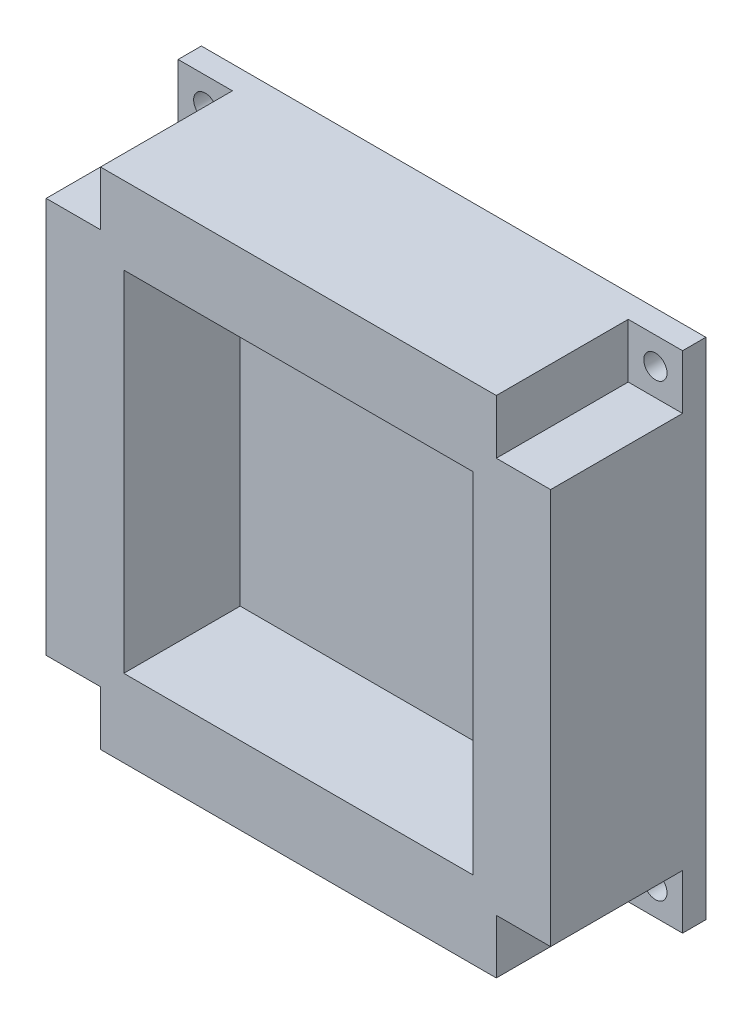
ISO-10303-21;
HEADER;
FILE_DESCRIPTION(('STEP AP214'),'2;1');
FILE_NAME('part.step','',(''),(''),'','','');
FILE_SCHEMA(('AUTOMOTIVE_DESIGN { 1 0 10303 214 1 1 1 1 }'));
ENDSEC;
DATA;
#1=APPLICATION_CONTEXT('core data for automotive mechanical design processes');
#2=APPLICATION_PROTOCOL_DEFINITION('international standard','automotive_design',2000,#1);
#3=PRODUCT_CONTEXT('',#1,'mechanical');
#4=PRODUCT('Part','Part','',(#3));
#5=PRODUCT_RELATED_PRODUCT_CATEGORY('part','',(#4));
#6=PRODUCT_DEFINITION_FORMATION('','',#4);
#7=PRODUCT_DEFINITION_CONTEXT('part definition',#1,'design');
#8=PRODUCT_DEFINITION('design','',#6,#7);
#9=PRODUCT_DEFINITION_SHAPE('','',#8);
#10=(LENGTH_UNIT() NAMED_UNIT(*) SI_UNIT(.MILLI.,.METRE.));
#11=(NAMED_UNIT(*) PLANE_ANGLE_UNIT() SI_UNIT($,.RADIAN.));
#12=(NAMED_UNIT(*) SI_UNIT($,.STERADIAN.) SOLID_ANGLE_UNIT());
#13=UNCERTAINTY_MEASURE_WITH_UNIT(LENGTH_MEASURE(1.E-05),#10,'distance_accuracy_value','');
#14=(GEOMETRIC_REPRESENTATION_CONTEXT(3) GLOBAL_UNCERTAINTY_ASSIGNED_CONTEXT((#13)) GLOBAL_UNIT_ASSIGNED_CONTEXT((#10,
#11,#12)) REPRESENTATION_CONTEXT('',''));
#15=CARTESIAN_POINT('',(0.,0.,0.));
#16=DIRECTION('',(0.,0.,1.));
#17=DIRECTION('',(1.,0.,0.));
#18=AXIS2_PLACEMENT_3D('',#15,#16,#17);
#19=CARTESIAN_POINT('',(32.5,32.5,20.));
#20=DIRECTION('',(-1.,0.,0.));
#21=DIRECTION('',(0.,-1.,0.));
#22=AXIS2_PLACEMENT_3D('',#19,#20,#21);
#23=PLANE('',#22);
#24=DIRECTION('',(0.,1.,0.));
#25=VECTOR('',#24,1.);
#26=CARTESIAN_POINT('',(32.5,32.5,20.));
#27=LINE('',#26,#25);
#28=CARTESIAN_POINT('',(32.5,-25.5,20.));
#29=VERTEX_POINT('',#28);
#30=CARTESIAN_POINT('',(32.4999999999997,25.5000000000003,20.));
#31=VERTEX_POINT('',#30);
#32=EDGE_CURVE('E302',#29,#31,#27,.T.);
#33=ORIENTED_EDGE('',*,*,#32,.F.);
#34=DIRECTION('',(0.,0.,1.));
#35=VECTOR('',#34,1.);
#36=CARTESIAN_POINT('',(32.5,-25.5,3.00000000000003));
#37=LINE('',#36,#35);
#38=CARTESIAN_POINT('',(32.5,-25.5,3.00000000000003));
#39=VERTEX_POINT('',#38);
#40=EDGE_CURVE('E55',#39,#29,#37,.T.);
#41=ORIENTED_EDGE('',*,*,#40,.F.);
#42=DIRECTION('',(0.,1.,0.));
#43=VECTOR('',#42,1.);
#44=CARTESIAN_POINT('',(32.5,-32.5,3.00000000000003));
#45=LINE('',#44,#43);
#46=CARTESIAN_POINT('',(32.5,-32.5,3.00000000000003));
#47=VERTEX_POINT('',#46);
#48=EDGE_CURVE('E202',#47,#39,#45,.T.);
#49=ORIENTED_EDGE('',*,*,#48,.F.);
#50=DIRECTION('',(0.,0.,-1.));
#51=VECTOR('',#50,1.);
#52=CARTESIAN_POINT('',(32.5,-32.5,20.));
#53=LINE('',#52,#51);
#54=CARTESIAN_POINT('',(32.5,-32.5,0.));
#55=VERTEX_POINT('',#54);
#56=EDGE_CURVE('E312',#47,#55,#53,.T.);
#57=ORIENTED_EDGE('',*,*,#56,.T.);
#58=DIRECTION('',(0.,1.,0.));
#59=VECTOR('',#58,1.);
#60=CARTESIAN_POINT('',(32.5,32.5,0.));
#61=LINE('',#60,#59);
#62=CARTESIAN_POINT('',(32.5,32.5,0.));
#63=VERTEX_POINT('',#62);
#64=EDGE_CURVE('E295',#55,#63,#61,.T.);
#65=ORIENTED_EDGE('',*,*,#64,.T.);
#66=DIRECTION('',(0.,0.,-1.));
#67=VECTOR('',#66,1.);
#68=CARTESIAN_POINT('',(32.5,32.5,20.));
#69=LINE('',#68,#67);
#70=CARTESIAN_POINT('',(32.4999999999997,32.5000000000003,3.00000000000003));
#71=VERTEX_POINT('',#70);
#72=EDGE_CURVE('E11',#71,#63,#69,.T.);
#73=ORIENTED_EDGE('',*,*,#72,.F.);
#74=DIRECTION('',(0.,1.,0.));
#75=VECTOR('',#74,1.);
#76=CARTESIAN_POINT('',(32.4999999999997,32.5000000000003,3.00000000000003));
#77=LINE('',#76,#75);
#78=CARTESIAN_POINT('',(32.4999999999997,25.5000000000003,3.00000000000003));
#79=VERTEX_POINT('',#78);
#80=EDGE_CURVE('E234',#79,#71,#77,.T.);
#81=ORIENTED_EDGE('',*,*,#80,.F.);
#82=DIRECTION('',(0.,0.,1.));
#83=VECTOR('',#82,1.);
#84=CARTESIAN_POINT('',(32.4999999999997,25.5000000000003,3.00000000000003));
#85=LINE('',#84,#83);
#86=EDGE_CURVE('E216',#79,#31,#85,.T.);
#87=ORIENTED_EDGE('',*,*,#86,.T.);
#88=EDGE_LOOP('',(#33,#41,#49,#57,#65,#73,#81,#87));
#89=FACE_BOUND('',#88,.T.);
#90=ADVANCED_FACE('F33',(#89),#23,.F.);
#91=CARTESIAN_POINT('',(-32.5,32.5,20.));
#92=DIRECTION('',(0.,-1.,0.));
#93=DIRECTION('',(0.,0.,-1.));
#94=AXIS2_PLACEMENT_3D('',#91,#92,#93);
#95=PLANE('',#94);
#96=DIRECTION('',(-1.,0.,0.));
#97=VECTOR('',#96,1.);
#98=CARTESIAN_POINT('',(-32.5,32.5,20.));
#99=LINE('',#98,#97);
#100=CARTESIAN_POINT('',(25.4999999999997,32.5,20.));
#101=VERTEX_POINT('',#100);
#102=CARTESIAN_POINT('',(-25.5,32.5,20.));
#103=VERTEX_POINT('',#102);
#104=EDGE_CURVE('E305',#101,#103,#99,.T.);
#105=ORIENTED_EDGE('',*,*,#104,.F.);
#106=DIRECTION('',(0.,0.,1.));
#107=VECTOR('',#106,1.);
#108=CARTESIAN_POINT('',(25.4999999999997,32.5000000000003,3.00000000000003));
#109=LINE('',#108,#107);
#110=CARTESIAN_POINT('',(25.4999999999997,32.5000000000003,3.00000000000003));
#111=VERTEX_POINT('',#110);
#112=EDGE_CURVE('E47',#111,#101,#109,.T.);
#113=ORIENTED_EDGE('',*,*,#112,.F.);
#114=DIRECTION('',(-1.,0.,0.));
#115=VECTOR('',#114,1.);
#116=CARTESIAN_POINT('',(32.4999999999997,32.5000000000003,3.00000000000003));
#117=LINE('',#116,#115);
#118=EDGE_CURVE('E224',#71,#111,#117,.T.);
#119=ORIENTED_EDGE('',*,*,#118,.F.);
#120=ORIENTED_EDGE('',*,*,#72,.T.);
#121=DIRECTION('',(-1.,0.,0.));
#122=VECTOR('',#121,1.);
#123=CARTESIAN_POINT('',(-32.5,32.5,0.));
#124=LINE('',#123,#122);
#125=CARTESIAN_POINT('',(-32.5,32.5,0.));
#126=VERTEX_POINT('',#125);
#127=EDGE_CURVE('E315',#63,#126,#124,.T.);
#128=ORIENTED_EDGE('',*,*,#127,.T.);
#129=DIRECTION('',(0.,0.,-1.));
#130=VECTOR('',#129,1.);
#131=CARTESIAN_POINT('',(-32.5,32.5,20.));
#132=LINE('',#131,#130);
#133=CARTESIAN_POINT('',(-32.5,32.5,3.00000000000003));
#134=VERTEX_POINT('',#133);
#135=EDGE_CURVE('E40',#134,#126,#132,.T.);
#136=ORIENTED_EDGE('',*,*,#135,.F.);
#137=DIRECTION('',(-1.,0.,0.));
#138=VECTOR('',#137,1.);
#139=CARTESIAN_POINT('',(-32.5,32.5,3.00000000000003));
#140=LINE('',#139,#138);
#141=CARTESIAN_POINT('',(-25.5,32.5,3.00000000000003));
#142=VERTEX_POINT('',#141);
#143=EDGE_CURVE('E255',#142,#134,#140,.T.);
#144=ORIENTED_EDGE('',*,*,#143,.F.);
#145=DIRECTION('',(0.,0.,1.));
#146=VECTOR('',#145,1.);
#147=CARTESIAN_POINT('',(-25.5,32.5,3.00000000000003));
#148=LINE('',#147,#146);
#149=EDGE_CURVE('E263',#142,#103,#148,.T.);
#150=ORIENTED_EDGE('',*,*,#149,.T.);
#151=EDGE_LOOP('',(#105,#113,#119,#120,#128,#136,#144,#150));
#152=FACE_BOUND('',#151,.T.);
#153=ADVANCED_FACE('F336',(#152),#95,.F.);
#154=CARTESIAN_POINT('',(-32.5,32.5,20.));
#155=DIRECTION('',(1.,0.,0.));
#156=DIRECTION('',(0.,1.,0.));
#157=AXIS2_PLACEMENT_3D('',#154,#155,#156);
#158=PLANE('',#157);
#159=DIRECTION('',(0.,-1.,0.));
#160=VECTOR('',#159,1.);
#161=CARTESIAN_POINT('',(-32.4999999999999,-32.5000000000001,3.00000000000003));
#162=LINE('',#161,#160);
#163=CARTESIAN_POINT('',(-32.4999999999999,-25.5000000000001,3.00000000000003));
#164=VERTEX_POINT('',#163);
#165=CARTESIAN_POINT('',(-32.4999999999999,-32.5000000000001,3.00000000000003));
#166=VERTEX_POINT('',#165);
#167=EDGE_CURVE('E186',#164,#166,#162,.T.);
#168=ORIENTED_EDGE('',*,*,#167,.F.);
#169=DIRECTION('',(0.,0.,1.));
#170=VECTOR('',#169,1.);
#171=CARTESIAN_POINT('',(-32.4999999999999,-25.5000000000001,3.00000000000003));
#172=LINE('',#171,#170);
#173=CARTESIAN_POINT('',(-32.4999999999999,-25.5000000000001,20.));
#174=VERTEX_POINT('',#173);
#175=EDGE_CURVE('E197',#164,#174,#172,.T.);
#176=ORIENTED_EDGE('',*,*,#175,.T.);
#177=DIRECTION('',(0.,-1.,0.));
#178=VECTOR('',#177,1.);
#179=CARTESIAN_POINT('',(-32.5,32.5,20.));
#180=LINE('',#179,#178);
#181=CARTESIAN_POINT('',(-32.5,25.5,20.));
#182=VERTEX_POINT('',#181);
#183=EDGE_CURVE('E308',#182,#174,#180,.T.);
#184=ORIENTED_EDGE('',*,*,#183,.F.);
#185=DIRECTION('',(0.,0.,1.));
#186=VECTOR('',#185,1.);
#187=CARTESIAN_POINT('',(-32.5,25.5,3.00000000000003));
#188=LINE('',#187,#186);
#189=CARTESIAN_POINT('',(-32.5,25.5,3.00000000000003));
#190=VERTEX_POINT('',#189);
#191=EDGE_CURVE('E257',#190,#182,#188,.T.);
#192=ORIENTED_EDGE('',*,*,#191,.F.);
#193=DIRECTION('',(0.,-1.,0.));
#194=VECTOR('',#193,1.);
#195=CARTESIAN_POINT('',(-32.5,32.5,3.00000000000003));
#196=LINE('',#195,#194);
#197=EDGE_CURVE('E245',#134,#190,#196,.T.);
#198=ORIENTED_EDGE('',*,*,#197,.F.);
#199=ORIENTED_EDGE('',*,*,#135,.T.);
#200=DIRECTION('',(0.,-1.,0.));
#201=VECTOR('',#200,1.);
#202=CARTESIAN_POINT('',(-32.5,32.5,0.));
#203=LINE('',#202,#201);
#204=CARTESIAN_POINT('',(-32.5,-32.5,0.));
#205=VERTEX_POINT('',#204);
#206=EDGE_CURVE('E318',#126,#205,#203,.T.);
#207=ORIENTED_EDGE('',*,*,#206,.T.);
#208=DIRECTION('',(0.,0.,-1.));
#209=VECTOR('',#208,1.);
#210=CARTESIAN_POINT('',(-32.5,-32.5,20.));
#211=LINE('',#210,#209);
#212=EDGE_CURVE('E324',#166,#205,#211,.T.);
#213=ORIENTED_EDGE('',*,*,#212,.F.);
#214=EDGE_LOOP('',(#168,#176,#184,#192,#198,#199,#207,#213));
#215=FACE_BOUND('',#214,.T.);
#216=ADVANCED_FACE('F328',(#215),#158,.F.);
#217=CARTESIAN_POINT('',(-32.5,-32.5,20.));
#218=DIRECTION('',(0.,1.,0.));
#219=DIRECTION('',(0.,0.,1.));
#220=AXIS2_PLACEMENT_3D('',#217,#218,#219);
#221=PLANE('',#220);
#222=DIRECTION('',(1.,0.,0.));
#223=VECTOR('',#222,1.);
#224=CARTESIAN_POINT('',(-32.5,-32.5,20.));
#225=LINE('',#224,#223);
#226=CARTESIAN_POINT('',(-25.4999999999999,-32.5,20.));
#227=VERTEX_POINT('',#226);
#228=CARTESIAN_POINT('',(25.5,-32.5,20.));
#229=VERTEX_POINT('',#228);
#230=EDGE_CURVE('E195',#227,#229,#225,.T.);
#231=ORIENTED_EDGE('',*,*,#230,.F.);
#232=DIRECTION('',(0.,0.,1.));
#233=VECTOR('',#232,1.);
#234=CARTESIAN_POINT('',(-25.4999999999999,-32.5000000000001,3.00000000000003));
#235=LINE('',#234,#233);
#236=CARTESIAN_POINT('',(-25.4999999999999,-32.5000000000001,3.00000000000003));
#237=VERTEX_POINT('',#236);
#238=EDGE_CURVE('E174',#237,#227,#235,.T.);
#239=ORIENTED_EDGE('',*,*,#238,.F.);
#240=DIRECTION('',(1.,0.,0.));
#241=VECTOR('',#240,1.);
#242=CARTESIAN_POINT('',(-32.4999999999999,-32.5000000000001,3.00000000000003));
#243=LINE('',#242,#241);
#244=EDGE_CURVE('E181',#166,#237,#243,.T.);
#245=ORIENTED_EDGE('',*,*,#244,.F.);
#246=ORIENTED_EDGE('',*,*,#212,.T.);
#247=DIRECTION('',(1.,0.,0.));
#248=VECTOR('',#247,1.);
#249=CARTESIAN_POINT('',(-32.5,-32.5,0.));
#250=LINE('',#249,#248);
#251=EDGE_CURVE('E306',#205,#55,#250,.T.);
#252=ORIENTED_EDGE('',*,*,#251,.T.);
#253=ORIENTED_EDGE('',*,*,#56,.F.);
#254=DIRECTION('',(1.,0.,0.));
#255=VECTOR('',#254,1.);
#256=CARTESIAN_POINT('',(32.5,-32.5,3.00000000000003));
#257=LINE('',#256,#255);
#258=CARTESIAN_POINT('',(25.5,-32.5,3.00000000000003));
#259=VERTEX_POINT('',#258);
#260=EDGE_CURVE('E212',#259,#47,#257,.T.);
#261=ORIENTED_EDGE('',*,*,#260,.F.);
#262=DIRECTION('',(0.,0.,1.));
#263=VECTOR('',#262,1.);
#264=CARTESIAN_POINT('',(25.5,-32.5,3.00000000000003));
#265=LINE('',#264,#263);
#266=EDGE_CURVE('E218',#259,#229,#265,.T.);
#267=ORIENTED_EDGE('',*,*,#266,.T.);
#268=EDGE_LOOP('',(#231,#239,#245,#246,#252,#253,#261,#267));
#269=FACE_BOUND('',#268,.T.);
#270=ADVANCED_FACE('F192',(#269),#221,.F.);
#271=CARTESIAN_POINT('',(0.,0.,20.));
#272=DIRECTION('',(0.,0.,1.));
#273=DIRECTION('',(1.,0.,0.));
#274=AXIS2_PLACEMENT_3D('',#271,#272,#273);
#275=PLANE('',#274);
#276=DIRECTION('',(-1.,0.,0.));
#277=VECTOR('',#276,1.);
#278=CARTESIAN_POINT('',(-32.4999999999999,-25.5000000000001,20.));
#279=LINE('',#278,#277);
#280=CARTESIAN_POINT('',(-25.4999999999999,-25.5000000000001,20.));
#281=VERTEX_POINT('',#280);
#282=EDGE_CURVE('E189',#281,#174,#279,.T.);
#283=ORIENTED_EDGE('',*,*,#282,.F.);
#284=DIRECTION('',(0.,1.,0.));
#285=VECTOR('',#284,1.);
#286=CARTESIAN_POINT('',(-25.4999999999999,-32.5000000000001,20.));
#287=LINE('',#286,#285);
#288=EDGE_CURVE('E220',#227,#281,#287,.T.);
#289=ORIENTED_EDGE('',*,*,#288,.F.);
#290=ORIENTED_EDGE('',*,*,#230,.T.);
#291=DIRECTION('',(0.,-1.,0.));
#292=VECTOR('',#291,1.);
#293=CARTESIAN_POINT('',(25.5,-32.5,20.));
#294=LINE('',#293,#292);
#295=CARTESIAN_POINT('',(25.5,-25.5,20.));
#296=VERTEX_POINT('',#295);
#297=EDGE_CURVE('E206',#296,#229,#294,.T.);
#298=ORIENTED_EDGE('',*,*,#297,.F.);
#299=DIRECTION('',(-1.,0.,0.));
#300=VECTOR('',#299,1.);
#301=CARTESIAN_POINT('',(32.5,-25.5,20.));
#302=LINE('',#301,#300);
#303=EDGE_CURVE('E214',#29,#296,#302,.T.);
#304=ORIENTED_EDGE('',*,*,#303,.F.);
#305=ORIENTED_EDGE('',*,*,#32,.T.);
#306=DIRECTION('',(1.,0.,0.));
#307=VECTOR('',#306,1.);
#308=CARTESIAN_POINT('',(32.4999999999997,25.5000000000003,20.));
#309=LINE('',#308,#307);
#310=CARTESIAN_POINT('',(25.4999999999997,25.5000000000003,20.));
#311=VERTEX_POINT('',#310);
#312=EDGE_CURVE('E228',#311,#31,#309,.T.);
#313=ORIENTED_EDGE('',*,*,#312,.F.);
#314=DIRECTION('',(0.,-1.,0.));
#315=VECTOR('',#314,1.);
#316=CARTESIAN_POINT('',(25.4999999999997,32.5000000000003,20.));
#317=LINE('',#316,#315);
#318=EDGE_CURVE('E236',#101,#311,#317,.T.);
#319=ORIENTED_EDGE('',*,*,#318,.F.);
#320=ORIENTED_EDGE('',*,*,#104,.T.);
#321=DIRECTION('',(0.,1.,0.));
#322=VECTOR('',#321,1.);
#323=CARTESIAN_POINT('',(-25.5,32.5,20.));
#324=LINE('',#323,#322);
#325=CARTESIAN_POINT('',(-25.5,25.5,20.));
#326=VERTEX_POINT('',#325);
#327=EDGE_CURVE('E249',#326,#103,#324,.T.);
#328=ORIENTED_EDGE('',*,*,#327,.F.);
#329=DIRECTION('',(1.,0.,0.));
#330=VECTOR('',#329,1.);
#331=CARTESIAN_POINT('',(-32.5,25.5,20.));
#332=LINE('',#331,#330);
#333=EDGE_CURVE('E258',#182,#326,#332,.T.);
#334=ORIENTED_EDGE('',*,*,#333,.F.);
#335=ORIENTED_EDGE('',*,*,#183,.T.);
#336=EDGE_LOOP('',(#283,#289,#290,#298,#304,#305,#313,#319,#320,#328,#334,#335));
#337=FACE_BOUND('',#336,.T.);
#338=DIRECTION('',(0.,1.,0.));
#339=VECTOR('',#338,1.);
#340=CARTESIAN_POINT('',(22.5,22.5,20.));
#341=LINE('',#340,#339);
#342=CARTESIAN_POINT('',(22.5,-22.5,20.));
#343=VERTEX_POINT('',#342);
#344=CARTESIAN_POINT('',(22.5,22.5,20.));
#345=VERTEX_POINT('',#344);
#346=EDGE_CURVE('E266',#343,#345,#341,.T.);
#347=ORIENTED_EDGE('',*,*,#346,.F.);
#348=DIRECTION('',(1.,0.,0.));
#349=VECTOR('',#348,1.);
#350=CARTESIAN_POINT('',(-22.5,-22.5,20.));
#351=LINE('',#350,#349);
#352=CARTESIAN_POINT('',(-22.5,-22.5,20.));
#353=VERTEX_POINT('',#352);
#354=EDGE_CURVE('E274',#353,#343,#351,.T.);
#355=ORIENTED_EDGE('',*,*,#354,.F.);
#356=DIRECTION('',(0.,-1.,0.));
#357=VECTOR('',#356,1.);
#358=CARTESIAN_POINT('',(-22.5,22.5,20.));
#359=LINE('',#358,#357);
#360=CARTESIAN_POINT('',(-22.5,22.5,20.));
#361=VERTEX_POINT('',#360);
#362=EDGE_CURVE('E288',#361,#353,#359,.T.);
#363=ORIENTED_EDGE('',*,*,#362,.F.);
#364=DIRECTION('',(-1.,0.,0.));
#365=VECTOR('',#364,1.);
#366=CARTESIAN_POINT('',(-22.5,22.5,20.));
#367=LINE('',#366,#365);
#368=EDGE_CURVE('E285',#345,#361,#367,.T.);
#369=ORIENTED_EDGE('',*,*,#368,.F.);
#370=EDGE_LOOP('',(#347,#355,#363,#369));
#371=FACE_BOUND('',#370,.T.);
#372=ADVANCED_FACE('F350',(#337,#371),#275,.T.);
#373=CARTESIAN_POINT('',(0.,0.,0.));
#374=DIRECTION('',(0.,0.,1.));
#375=DIRECTION('',(1.,0.,0.));
#376=AXIS2_PLACEMENT_3D('',#373,#374,#375);
#377=PLANE('',#376);
#378=CARTESIAN_POINT('',(-28.9999999999999,-29.0000000000001,0.));
#379=DIRECTION('',(0.,0.,1.));
#380=DIRECTION('',(0.,1.,0.));
#381=AXIS2_PLACEMENT_3D('',#378,#379,#380);
#382=CIRCLE('',#381,1.5);
#383=CARTESIAN_POINT('',(-28.9999999999999,-27.5000000000001,0.));
#384=VERTEX_POINT('',#383);
#385=EDGE_CURVE('E411',#384,#384,#382,.T.);
#386=ORIENTED_EDGE('',*,*,#385,.T.);
#387=EDGE_LOOP('',(#386));
#388=FACE_BOUND('',#387,.T.);
#389=CARTESIAN_POINT('',(29.,-29.,0.));
#390=DIRECTION('',(0.,0.,1.));
#391=DIRECTION('',(-1.,0.,0.));
#392=AXIS2_PLACEMENT_3D('',#389,#390,#391);
#393=CIRCLE('',#392,1.5);
#394=CARTESIAN_POINT('',(27.5,-29.,0.));
#395=VERTEX_POINT('',#394);
#396=EDGE_CURVE('E647',#395,#395,#393,.T.);
#397=ORIENTED_EDGE('',*,*,#396,.T.);
#398=EDGE_LOOP('',(#397));
#399=FACE_BOUND('',#398,.T.);
#400=CARTESIAN_POINT('',(28.9999999999997,29.0000000000003,0.));
#401=DIRECTION('',(0.,0.,1.));
#402=DIRECTION('',(0.,-1.,0.));
#403=AXIS2_PLACEMENT_3D('',#400,#401,#402);
#404=CIRCLE('',#403,1.5);
#405=CARTESIAN_POINT('',(28.9999999999997,27.5000000000003,0.));
#406=VERTEX_POINT('',#405);
#407=EDGE_CURVE('E649',#406,#406,#404,.T.);
#408=ORIENTED_EDGE('',*,*,#407,.T.);
#409=EDGE_LOOP('',(#408));
#410=FACE_BOUND('',#409,.T.);
#411=CARTESIAN_POINT('',(-29.,29.,0.));
#412=DIRECTION('',(0.,0.,1.));
#413=DIRECTION('',(1.,0.,0.));
#414=AXIS2_PLACEMENT_3D('',#411,#412,#413);
#415=CIRCLE('',#414,1.5);
#416=CARTESIAN_POINT('',(-27.5,29.,0.));
#417=VERTEX_POINT('',#416);
#418=EDGE_CURVE('E238',#417,#417,#415,.T.);
#419=ORIENTED_EDGE('',*,*,#418,.T.);
#420=EDGE_LOOP('',(#419));
#421=FACE_BOUND('',#420,.T.);
#422=ORIENTED_EDGE('',*,*,#64,.F.);
#423=ORIENTED_EDGE('',*,*,#251,.F.);
#424=ORIENTED_EDGE('',*,*,#206,.F.);
#425=ORIENTED_EDGE('',*,*,#127,.F.);
#426=EDGE_LOOP('',(#422,#423,#424,#425));
#427=FACE_BOUND('',#426,.T.);
#428=ADVANCED_FACE('F341',(#388,#399,#410,#421,#427),#377,.F.);
#429=CARTESIAN_POINT('',(22.5,22.5,5.00000000000003));
#430=DIRECTION('',(1.,0.,0.));
#431=DIRECTION('',(0.,1.,0.));
#432=AXIS2_PLACEMENT_3D('',#429,#430,#431);
#433=PLANE('',#432);
#434=ORIENTED_EDGE('',*,*,#346,.T.);
#435=DIRECTION('',(0.,0.,1.));
#436=VECTOR('',#435,1.);
#437=CARTESIAN_POINT('',(22.5,22.5,5.00000000000003));
#438=LINE('',#437,#436);
#439=CARTESIAN_POINT('',(22.5,22.5,5.00000000000003));
#440=VERTEX_POINT('',#439);
#441=EDGE_CURVE('E283',#440,#345,#438,.T.);
#442=ORIENTED_EDGE('',*,*,#441,.F.);
#443=DIRECTION('',(0.,1.,0.));
#444=VECTOR('',#443,1.);
#445=CARTESIAN_POINT('',(22.5,22.5,5.00000000000003));
#446=LINE('',#445,#444);
#447=CARTESIAN_POINT('',(22.5,-22.5,5.00000000000003));
#448=VERTEX_POINT('',#447);
#449=EDGE_CURVE('E270',#448,#440,#446,.T.);
#450=ORIENTED_EDGE('',*,*,#449,.F.);
#451=DIRECTION('',(0.,0.,1.));
#452=VECTOR('',#451,1.);
#453=CARTESIAN_POINT('',(22.5,-22.5,5.00000000000003));
#454=LINE('',#453,#452);
#455=EDGE_CURVE('E293',#448,#343,#454,.T.);
#456=ORIENTED_EDGE('',*,*,#455,.T.);
#457=EDGE_LOOP('',(#434,#442,#450,#456));
#458=FACE_BOUND('',#457,.T.);
#459=ADVANCED_FACE('F505',(#458),#433,.F.);
#460=CARTESIAN_POINT('',(-22.5,-22.5,5.00000000000003));
#461=DIRECTION('',(0.,-1.,0.));
#462=DIRECTION('',(0.,0.,-1.));
#463=AXIS2_PLACEMENT_3D('',#460,#461,#462);
#464=PLANE('',#463);
#465=ORIENTED_EDGE('',*,*,#354,.T.);
#466=ORIENTED_EDGE('',*,*,#455,.F.);
#467=DIRECTION('',(1.,0.,0.));
#468=VECTOR('',#467,1.);
#469=CARTESIAN_POINT('',(-22.5,-22.5,5.00000000000003));
#470=LINE('',#469,#468);
#471=CARTESIAN_POINT('',(-22.5,-22.5,5.00000000000003));
#472=VERTEX_POINT('',#471);
#473=EDGE_CURVE('E280',#472,#448,#470,.T.);
#474=ORIENTED_EDGE('',*,*,#473,.F.);
#475=DIRECTION('',(0.,0.,1.));
#476=VECTOR('',#475,1.);
#477=CARTESIAN_POINT('',(-22.5,-22.5,5.00000000000003));
#478=LINE('',#477,#476);
#479=EDGE_CURVE('E296',#472,#353,#478,.T.);
#480=ORIENTED_EDGE('',*,*,#479,.T.);
#481=EDGE_LOOP('',(#465,#466,#474,#480));
#482=FACE_BOUND('',#481,.T.);
#483=ADVANCED_FACE('F511',(#482),#464,.F.);
#484=CARTESIAN_POINT('',(-22.5,22.5,5.00000000000003));
#485=DIRECTION('',(-1.,0.,0.));
#486=DIRECTION('',(0.,-1.,0.));
#487=AXIS2_PLACEMENT_3D('',#484,#485,#486);
#488=PLANE('',#487);
#489=ORIENTED_EDGE('',*,*,#362,.T.);
#490=ORIENTED_EDGE('',*,*,#479,.F.);
#491=DIRECTION('',(0.,-1.,0.));
#492=VECTOR('',#491,1.);
#493=CARTESIAN_POINT('',(-22.5,22.5,5.00000000000003));
#494=LINE('',#493,#492);
#495=CARTESIAN_POINT('',(-22.5,22.5,5.00000000000003));
#496=VERTEX_POINT('',#495);
#497=EDGE_CURVE('E277',#496,#472,#494,.T.);
#498=ORIENTED_EDGE('',*,*,#497,.F.);
#499=DIRECTION('',(0.,0.,1.));
#500=VECTOR('',#499,1.);
#501=CARTESIAN_POINT('',(-22.5,22.5,5.00000000000003));
#502=LINE('',#501,#500);
#503=EDGE_CURVE('E298',#496,#361,#502,.T.);
#504=ORIENTED_EDGE('',*,*,#503,.T.);
#505=EDGE_LOOP('',(#489,#490,#498,#504));
#506=FACE_BOUND('',#505,.T.);
#507=ADVANCED_FACE('F580',(#506),#488,.F.);
#508=CARTESIAN_POINT('',(-22.5,22.5,5.00000000000003));
#509=DIRECTION('',(0.,1.,0.));
#510=DIRECTION('',(0.,0.,1.));
#511=AXIS2_PLACEMENT_3D('',#508,#509,#510);
#512=PLANE('',#511);
#513=ORIENTED_EDGE('',*,*,#368,.T.);
#514=ORIENTED_EDGE('',*,*,#503,.F.);
#515=DIRECTION('',(-1.,0.,0.));
#516=VECTOR('',#515,1.);
#517=CARTESIAN_POINT('',(-22.5,22.5,5.00000000000003));
#518=LINE('',#517,#516);
#519=EDGE_CURVE('E273',#440,#496,#518,.T.);
#520=ORIENTED_EDGE('',*,*,#519,.F.);
#521=ORIENTED_EDGE('',*,*,#441,.T.);
#522=EDGE_LOOP('',(#513,#514,#520,#521));
#523=FACE_BOUND('',#522,.T.);
#524=ADVANCED_FACE('F368',(#523),#512,.F.);
#525=CARTESIAN_POINT('',(0.,0.,5.00000000000003));
#526=DIRECTION('',(0.,0.,1.));
#527=DIRECTION('',(1.,0.,0.));
#528=AXIS2_PLACEMENT_3D('',#525,#526,#527);
#529=PLANE('',#528);
#530=ORIENTED_EDGE('',*,*,#449,.T.);
#531=ORIENTED_EDGE('',*,*,#519,.T.);
#532=ORIENTED_EDGE('',*,*,#497,.T.);
#533=ORIENTED_EDGE('',*,*,#473,.T.);
#534=EDGE_LOOP('',(#530,#531,#532,#533));
#535=FACE_BOUND('',#534,.T.);
#536=ADVANCED_FACE('F361',(#535),#529,.T.);
#537=CARTESIAN_POINT('',(-25.5,32.5,3.00000000000003));
#538=DIRECTION('',(1.,0.,0.));
#539=DIRECTION('',(0.,0.,-1.));
#540=AXIS2_PLACEMENT_3D('',#537,#538,#539);
#541=PLANE('',#540);
#542=ORIENTED_EDGE('',*,*,#327,.T.);
#543=ORIENTED_EDGE('',*,*,#149,.F.);
#544=DIRECTION('',(0.,1.,0.));
#545=VECTOR('',#544,1.);
#546=CARTESIAN_POINT('',(-25.5,32.5,3.00000000000003));
#547=LINE('',#546,#545);
#548=CARTESIAN_POINT('',(-25.5,25.5,3.00000000000003));
#549=VERTEX_POINT('',#548);
#550=EDGE_CURVE('E252',#549,#142,#547,.T.);
#551=ORIENTED_EDGE('',*,*,#550,.F.);
#552=DIRECTION('',(0.,0.,1.));
#553=VECTOR('',#552,1.);
#554=CARTESIAN_POINT('',(-25.5,25.5,3.00000000000003));
#555=LINE('',#554,#553);
#556=EDGE_CURVE('E267',#549,#326,#555,.T.);
#557=ORIENTED_EDGE('',*,*,#556,.T.);
#558=EDGE_LOOP('',(#542,#543,#551,#557));
#559=FACE_BOUND('',#558,.T.);
#560=ADVANCED_FACE('F359',(#559),#541,.F.);
#561=CARTESIAN_POINT('',(-32.5,25.5,3.00000000000003));
#562=DIRECTION('',(0.,-1.,0.));
#563=DIRECTION('',(0.,0.,-1.));
#564=AXIS2_PLACEMENT_3D('',#561,#562,#563);
#565=PLANE('',#564);
#566=ORIENTED_EDGE('',*,*,#333,.T.);
#567=ORIENTED_EDGE('',*,*,#556,.F.);
#568=DIRECTION('',(1.,0.,0.));
#569=VECTOR('',#568,1.);
#570=CARTESIAN_POINT('',(-32.5,25.5,3.00000000000003));
#571=LINE('',#570,#569);
#572=EDGE_CURVE('E248',#190,#549,#571,.T.);
#573=ORIENTED_EDGE('',*,*,#572,.F.);
#574=ORIENTED_EDGE('',*,*,#191,.T.);
#575=EDGE_LOOP('',(#566,#567,#573,#574));
#576=FACE_BOUND('',#575,.T.);
#577=ADVANCED_FACE('F354',(#576),#565,.F.);
#578=CARTESIAN_POINT('',(0.,0.,3.00000000000003));
#579=DIRECTION('',(0.,0.,1.));
#580=DIRECTION('',(1.,0.,0.));
#581=AXIS2_PLACEMENT_3D('',#578,#579,#580);
#582=PLANE('',#581);
#583=CARTESIAN_POINT('',(-29.,29.,3.00000000000003));
#584=DIRECTION('',(0.,0.,1.));
#585=DIRECTION('',(1.,0.,0.));
#586=AXIS2_PLACEMENT_3D('',#583,#584,#585);
#587=CIRCLE('',#586,1.5);
#588=CARTESIAN_POINT('',(-27.5,29.,3.00000000000003));
#589=VERTEX_POINT('',#588);
#590=EDGE_CURVE('E409',#589,#589,#587,.T.);
#591=ORIENTED_EDGE('',*,*,#590,.F.);
#592=EDGE_LOOP('',(#591));
#593=FACE_BOUND('',#592,.T.);
#594=ORIENTED_EDGE('',*,*,#197,.T.);
#595=ORIENTED_EDGE('',*,*,#572,.T.);
#596=ORIENTED_EDGE('',*,*,#550,.T.);
#597=ORIENTED_EDGE('',*,*,#143,.T.);
#598=EDGE_LOOP('',(#594,#595,#596,#597));
#599=FACE_BOUND('',#598,.T.);
#600=ADVANCED_FACE('F357',(#593,#599),#582,.T.);
#601=CARTESIAN_POINT('',(32.4999999999997,25.5000000000003,3.00000000000003));
#602=DIRECTION('',(0.,-1.,0.));
#603=DIRECTION('',(1.,0.,0.));
#604=AXIS2_PLACEMENT_3D('',#601,#602,#603);
#605=PLANE('',#604);
#606=ORIENTED_EDGE('',*,*,#312,.T.);
#607=ORIENTED_EDGE('',*,*,#86,.F.);
#608=DIRECTION('',(1.,0.,0.));
#609=VECTOR('',#608,1.);
#610=CARTESIAN_POINT('',(32.4999999999997,25.5000000000003,3.00000000000003));
#611=LINE('',#610,#609);
#612=CARTESIAN_POINT('',(25.4999999999997,25.5000000000003,3.00000000000003));
#613=VERTEX_POINT('',#612);
#614=EDGE_CURVE('E231',#613,#79,#611,.T.);
#615=ORIENTED_EDGE('',*,*,#614,.F.);
#616=DIRECTION('',(0.,0.,1.));
#617=VECTOR('',#616,1.);
#618=CARTESIAN_POINT('',(25.4999999999997,25.5000000000003,3.00000000000003));
#619=LINE('',#618,#617);
#620=EDGE_CURVE('E242',#613,#311,#619,.T.);
#621=ORIENTED_EDGE('',*,*,#620,.T.);
#622=EDGE_LOOP('',(#606,#607,#615,#621));
#623=FACE_BOUND('',#622,.T.);
#624=ADVANCED_FACE('F392',(#623),#605,.F.);
#625=CARTESIAN_POINT('',(25.4999999999997,32.5000000000003,3.00000000000003));
#626=DIRECTION('',(-1.,0.,0.));
#627=DIRECTION('',(0.,-1.,0.));
#628=AXIS2_PLACEMENT_3D('',#625,#626,#627);
#629=PLANE('',#628);
#630=ORIENTED_EDGE('',*,*,#318,.T.);
#631=ORIENTED_EDGE('',*,*,#620,.F.);
#632=DIRECTION('',(0.,-1.,0.));
#633=VECTOR('',#632,1.);
#634=CARTESIAN_POINT('',(25.4999999999997,32.5000000000003,3.00000000000003));
#635=LINE('',#634,#633);
#636=EDGE_CURVE('E227',#111,#613,#635,.T.);
#637=ORIENTED_EDGE('',*,*,#636,.F.);
#638=ORIENTED_EDGE('',*,*,#112,.T.);
#639=EDGE_LOOP('',(#630,#631,#637,#638));
#640=FACE_BOUND('',#639,.T.);
#641=ADVANCED_FACE('F393',(#640),#629,.F.);
#642=CARTESIAN_POINT('',(0.,0.,3.00000000000003));
#643=DIRECTION('',(0.,0.,1.));
#644=DIRECTION('',(0.,-1.,0.));
#645=AXIS2_PLACEMENT_3D('',#642,#643,#644);
#646=PLANE('',#645);
#647=CARTESIAN_POINT('',(28.9999999999997,29.0000000000003,3.00000000000003));
#648=DIRECTION('',(0.,0.,1.));
#649=DIRECTION('',(0.,-1.,0.));
#650=AXIS2_PLACEMENT_3D('',#647,#648,#649);
#651=CIRCLE('',#650,1.5);
#652=CARTESIAN_POINT('',(28.9999999999997,27.5000000000003,3.00000000000003));
#653=VERTEX_POINT('',#652);
#654=EDGE_CURVE('E651',#653,#653,#651,.T.);
#655=ORIENTED_EDGE('',*,*,#654,.F.);
#656=EDGE_LOOP('',(#655));
#657=FACE_BOUND('',#656,.T.);
#658=ORIENTED_EDGE('',*,*,#118,.T.);
#659=ORIENTED_EDGE('',*,*,#636,.T.);
#660=ORIENTED_EDGE('',*,*,#614,.T.);
#661=ORIENTED_EDGE('',*,*,#80,.T.);
#662=EDGE_LOOP('',(#658,#659,#660,#661));
#663=FACE_BOUND('',#662,.T.);
#664=ADVANCED_FACE('F389',(#657,#663),#646,.T.);
#665=CARTESIAN_POINT('',(25.5,-32.5,3.00000000000003));
#666=DIRECTION('',(-1.,0.,0.));
#667=DIRECTION('',(0.,0.,1.));
#668=AXIS2_PLACEMENT_3D('',#665,#666,#667);
#669=PLANE('',#668);
#670=ORIENTED_EDGE('',*,*,#297,.T.);
#671=ORIENTED_EDGE('',*,*,#266,.F.);
#672=DIRECTION('',(0.,-1.,0.));
#673=VECTOR('',#672,1.);
#674=CARTESIAN_POINT('',(25.5,-32.5,3.00000000000003));
#675=LINE('',#674,#673);
#676=CARTESIAN_POINT('',(25.5,-25.5,3.00000000000003));
#677=VERTEX_POINT('',#676);
#678=EDGE_CURVE('E209',#677,#259,#675,.T.);
#679=ORIENTED_EDGE('',*,*,#678,.F.);
#680=DIRECTION('',(0.,0.,1.));
#681=VECTOR('',#680,1.);
#682=CARTESIAN_POINT('',(25.5,-25.5,3.00000000000003));
#683=LINE('',#682,#681);
#684=EDGE_CURVE('E221',#677,#296,#683,.T.);
#685=ORIENTED_EDGE('',*,*,#684,.T.);
#686=EDGE_LOOP('',(#670,#671,#679,#685));
#687=FACE_BOUND('',#686,.T.);
#688=ADVANCED_FACE('F385',(#687),#669,.F.);
#689=CARTESIAN_POINT('',(32.5,-25.5,3.00000000000003));
#690=DIRECTION('',(0.,1.,0.));
#691=DIRECTION('',(0.,0.,1.));
#692=AXIS2_PLACEMENT_3D('',#689,#690,#691);
#693=PLANE('',#692);
#694=ORIENTED_EDGE('',*,*,#303,.T.);
#695=ORIENTED_EDGE('',*,*,#684,.F.);
#696=DIRECTION('',(-1.,0.,0.));
#697=VECTOR('',#696,1.);
#698=CARTESIAN_POINT('',(32.5,-25.5,3.00000000000003));
#699=LINE('',#698,#697);
#700=EDGE_CURVE('E205',#39,#677,#699,.T.);
#701=ORIENTED_EDGE('',*,*,#700,.F.);
#702=ORIENTED_EDGE('',*,*,#40,.T.);
#703=EDGE_LOOP('',(#694,#695,#701,#702));
#704=FACE_BOUND('',#703,.T.);
#705=ADVANCED_FACE('F382',(#704),#693,.F.);
#706=CARTESIAN_POINT('',(0.,0.,3.00000000000003));
#707=DIRECTION('',(0.,0.,1.));
#708=DIRECTION('',(-1.,0.,0.));
#709=AXIS2_PLACEMENT_3D('',#706,#707,#708);
#710=PLANE('',#709);
#711=CARTESIAN_POINT('',(29.,-29.,3.00000000000003));
#712=DIRECTION('',(0.,0.,1.));
#713=DIRECTION('',(-1.,0.,0.));
#714=AXIS2_PLACEMENT_3D('',#711,#712,#713);
#715=CIRCLE('',#714,1.5);
#716=CARTESIAN_POINT('',(27.5,-29.,3.00000000000003));
#717=VERTEX_POINT('',#716);
#718=EDGE_CURVE('E650',#717,#717,#715,.T.);
#719=ORIENTED_EDGE('',*,*,#718,.F.);
#720=EDGE_LOOP('',(#719));
#721=FACE_BOUND('',#720,.T.);
#722=ORIENTED_EDGE('',*,*,#48,.T.);
#723=ORIENTED_EDGE('',*,*,#700,.T.);
#724=ORIENTED_EDGE('',*,*,#678,.T.);
#725=ORIENTED_EDGE('',*,*,#260,.T.);
#726=EDGE_LOOP('',(#722,#723,#724,#725));
#727=FACE_BOUND('',#726,.T.);
#728=ADVANCED_FACE('F387',(#721,#727),#710,.T.);
#729=CARTESIAN_POINT('',(-32.4999999999999,-25.5000000000001,3.00000000000003));
#730=DIRECTION('',(0.,1.,0.));
#731=DIRECTION('',(-1.,0.,0.));
#732=AXIS2_PLACEMENT_3D('',#729,#730,#731);
#733=PLANE('',#732);
#734=ORIENTED_EDGE('',*,*,#282,.T.);
#735=ORIENTED_EDGE('',*,*,#175,.F.);
#736=DIRECTION('',(-1.,0.,0.));
#737=VECTOR('',#736,1.);
#738=CARTESIAN_POINT('',(-32.4999999999999,-25.5000000000001,3.00000000000003));
#739=LINE('',#738,#737);
#740=CARTESIAN_POINT('',(-25.4999999999999,-25.5000000000001,3.00000000000003));
#741=VERTEX_POINT('',#740);
#742=EDGE_CURVE('E180',#741,#164,#739,.T.);
#743=ORIENTED_EDGE('',*,*,#742,.F.);
#744=DIRECTION('',(0.,0.,1.));
#745=VECTOR('',#744,1.);
#746=CARTESIAN_POINT('',(-25.4999999999999,-25.5000000000001,3.00000000000003));
#747=LINE('',#746,#745);
#748=EDGE_CURVE('E176',#741,#281,#747,.T.);
#749=ORIENTED_EDGE('',*,*,#748,.T.);
#750=EDGE_LOOP('',(#734,#735,#743,#749));
#751=FACE_BOUND('',#750,.T.);
#752=ADVANCED_FACE('F422',(#751),#733,.F.);
#753=CARTESIAN_POINT('',(-25.4999999999999,-32.5000000000001,3.00000000000003));
#754=DIRECTION('',(1.,0.,0.));
#755=DIRECTION('',(0.,1.,0.));
#756=AXIS2_PLACEMENT_3D('',#753,#754,#755);
#757=PLANE('',#756);
#758=ORIENTED_EDGE('',*,*,#288,.T.);
#759=ORIENTED_EDGE('',*,*,#748,.F.);
#760=DIRECTION('',(0.,1.,0.));
#761=VECTOR('',#760,1.);
#762=CARTESIAN_POINT('',(-25.4999999999999,-32.5000000000001,3.00000000000003));
#763=LINE('',#762,#761);
#764=EDGE_CURVE('E169',#237,#741,#763,.T.);
#765=ORIENTED_EDGE('',*,*,#764,.F.);
#766=ORIENTED_EDGE('',*,*,#238,.T.);
#767=EDGE_LOOP('',(#758,#759,#765,#766));
#768=FACE_BOUND('',#767,.T.);
#769=ADVANCED_FACE('F172',(#768),#757,.F.);
#770=CARTESIAN_POINT('',(0.,0.,3.00000000000003));
#771=DIRECTION('',(0.,0.,1.));
#772=DIRECTION('',(0.,1.,0.));
#773=AXIS2_PLACEMENT_3D('',#770,#771,#772);
#774=PLANE('',#773);
#775=CARTESIAN_POINT('',(-28.9999999999999,-29.0000000000001,3.00000000000003));
#776=DIRECTION('',(0.,0.,1.));
#777=DIRECTION('',(0.,1.,0.));
#778=AXIS2_PLACEMENT_3D('',#775,#776,#777);
#779=CIRCLE('',#778,1.5);
#780=CARTESIAN_POINT('',(-28.9999999999999,-27.5000000000001,3.00000000000003));
#781=VERTEX_POINT('',#780);
#782=EDGE_CURVE('E416',#781,#781,#779,.T.);
#783=ORIENTED_EDGE('',*,*,#782,.F.);
#784=EDGE_LOOP('',(#783));
#785=FACE_BOUND('',#784,.T.);
#786=ORIENTED_EDGE('',*,*,#244,.T.);
#787=ORIENTED_EDGE('',*,*,#764,.T.);
#788=ORIENTED_EDGE('',*,*,#742,.T.);
#789=ORIENTED_EDGE('',*,*,#167,.T.);
#790=EDGE_LOOP('',(#786,#787,#788,#789));
#791=FACE_BOUND('',#790,.T.);
#792=ADVANCED_FACE('F184',(#785,#791),#774,.T.);
#793=CARTESIAN_POINT('',(-29.,29.,0.));
#794=DIRECTION('',(0.,0.,1.));
#795=DIRECTION('',(1.,0.,0.));
#796=AXIS2_PLACEMENT_3D('',#793,#794,#795);
#797=CYLINDRICAL_SURFACE('',#796,1.5);
#798=ORIENTED_EDGE('',*,*,#418,.F.);
#799=EDGE_LOOP('',(#798));
#800=FACE_BOUND('',#799,.T.);
#801=ORIENTED_EDGE('',*,*,#590,.T.);
#802=EDGE_LOOP('',(#801));
#803=FACE_BOUND('',#802,.T.);
#804=ADVANCED_FACE('F460',(#800,#803),#797,.F.);
#805=CARTESIAN_POINT('',(-28.9999999999999,-29.0000000000001,0.));
#806=DIRECTION('',(0.,0.,1.));
#807=DIRECTION('',(1.,0.,0.));
#808=AXIS2_PLACEMENT_3D('',#805,#806,#807);
#809=CYLINDRICAL_SURFACE('',#808,1.5);
#810=ORIENTED_EDGE('',*,*,#385,.F.);
#811=EDGE_LOOP('',(#810));
#812=FACE_BOUND('',#811,.T.);
#813=ORIENTED_EDGE('',*,*,#782,.T.);
#814=EDGE_LOOP('',(#813));
#815=FACE_BOUND('',#814,.T.);
#816=ADVANCED_FACE('F468',(#812,#815),#809,.F.);
#817=CARTESIAN_POINT('',(29.,-29.,0.));
#818=DIRECTION('',(0.,0.,1.));
#819=DIRECTION('',(1.,0.,0.));
#820=AXIS2_PLACEMENT_3D('',#817,#818,#819);
#821=CYLINDRICAL_SURFACE('',#820,1.5);
#822=ORIENTED_EDGE('',*,*,#396,.F.);
#823=EDGE_LOOP('',(#822));
#824=FACE_BOUND('',#823,.T.);
#825=ORIENTED_EDGE('',*,*,#718,.T.);
#826=EDGE_LOOP('',(#825));
#827=FACE_BOUND('',#826,.T.);
#828=ADVANCED_FACE('F473',(#824,#827),#821,.F.);
#829=CARTESIAN_POINT('',(28.9999999999997,29.0000000000003,0.));
#830=DIRECTION('',(0.,0.,1.));
#831=DIRECTION('',(1.,0.,0.));
#832=AXIS2_PLACEMENT_3D('',#829,#830,#831);
#833=CYLINDRICAL_SURFACE('',#832,1.5);
#834=ORIENTED_EDGE('',*,*,#407,.F.);
#835=EDGE_LOOP('',(#834));
#836=FACE_BOUND('',#835,.T.);
#837=ORIENTED_EDGE('',*,*,#654,.T.);
#838=EDGE_LOOP('',(#837));
#839=FACE_BOUND('',#838,.T.);
#840=ADVANCED_FACE('F483',(#836,#839),#833,.F.);
#841=CLOSED_SHELL('',(#90,#153,#216,#270,#372,#428,#459,#483,#507,#524,#536,#560,#577,#600,#624,
#641,#664,#688,#705,#728,#752,#769,#792,#804,#816,#828,#840));
#842=MANIFOLD_SOLID_BREP('B2',#841);
#843=ADVANCED_BREP_SHAPE_REPRESENTATION('',(#18,#842),#14);
#844=SHAPE_DEFINITION_REPRESENTATION(#9,#843);
ENDSEC;
END-ISO-10303-21;
